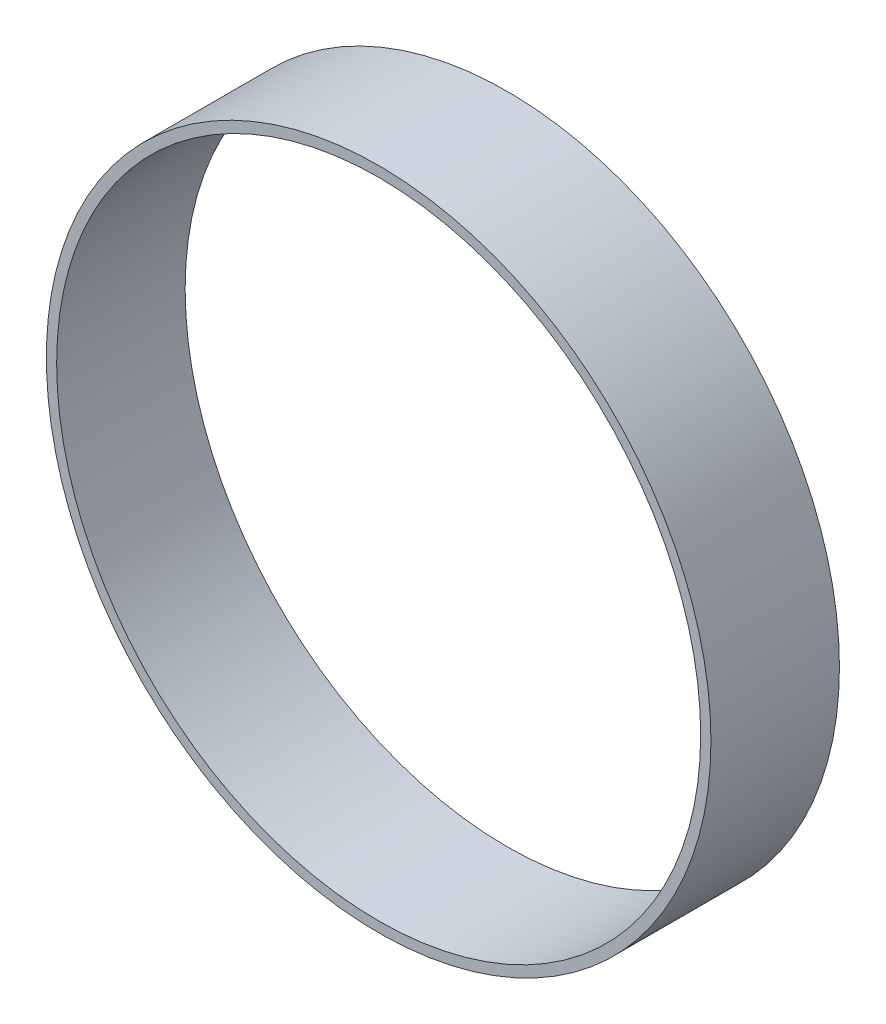
ISO-10303-21;
HEADER;
FILE_DESCRIPTION(('STEP AP214'),'2;1');
FILE_NAME('part.step','',(''),(''),'','','');
FILE_SCHEMA(('AUTOMOTIVE_DESIGN { 1 0 10303 214 1 1 1 1 }'));
ENDSEC;
DATA;
#1=APPLICATION_CONTEXT('core data for automotive mechanical design processes');
#2=APPLICATION_PROTOCOL_DEFINITION('international standard','automotive_design',2000,#1);
#3=PRODUCT_CONTEXT('',#1,'mechanical');
#4=PRODUCT('Part','Part','',(#3));
#5=PRODUCT_RELATED_PRODUCT_CATEGORY('part','',(#4));
#6=PRODUCT_DEFINITION_FORMATION('','',#4);
#7=PRODUCT_DEFINITION_CONTEXT('part definition',#1,'design');
#8=PRODUCT_DEFINITION('design','',#6,#7);
#9=PRODUCT_DEFINITION_SHAPE('','',#8);
#10=(LENGTH_UNIT() NAMED_UNIT(*) SI_UNIT(.MILLI.,.METRE.));
#11=(NAMED_UNIT(*) PLANE_ANGLE_UNIT() SI_UNIT($,.RADIAN.));
#12=(NAMED_UNIT(*) SI_UNIT($,.STERADIAN.) SOLID_ANGLE_UNIT());
#13=UNCERTAINTY_MEASURE_WITH_UNIT(LENGTH_MEASURE(1.E-05),#10,'distance_accuracy_value','');
#14=(GEOMETRIC_REPRESENTATION_CONTEXT(3) GLOBAL_UNCERTAINTY_ASSIGNED_CONTEXT((#13)) GLOBAL_UNIT_ASSIGNED_CONTEXT((#10,
#11,#12)) REPRESENTATION_CONTEXT('',''));
#15=CARTESIAN_POINT('',(0.,0.,0.));
#16=DIRECTION('',(0.,0.,1.));
#17=DIRECTION('',(1.,0.,0.));
#18=AXIS2_PLACEMENT_3D('',#15,#16,#17);
#19=CARTESIAN_POINT('',(0.,0.,6.35));
#20=DIRECTION('',(0.,0.,1.));
#21=DIRECTION('',(1.,0.,0.));
#22=AXIS2_PLACEMENT_3D('',#19,#20,#21);
#23=PLANE('',#22);
#24=CARTESIAN_POINT('',(0.,0.,6.35));
#25=DIRECTION('',(0.,0.,1.));
#26=DIRECTION('',(1.,0.,0.));
#27=AXIS2_PLACEMENT_3D('',#24,#25,#26);
#28=CIRCLE('',#27,16.4211);
#29=CARTESIAN_POINT('',(16.4211,0.,6.35));
#30=VERTEX_POINT('',#29);
#31=EDGE_CURVE('E10',#30,#30,#28,.T.);
#32=ORIENTED_EDGE('',*,*,#31,.T.);
#33=EDGE_LOOP('',(#32));
#34=FACE_BOUND('',#33,.T.);
#35=CARTESIAN_POINT('',(0.,0.,6.35));
#36=DIRECTION('',(0.,0.,1.));
#37=DIRECTION('',(1.,0.,0.));
#38=AXIS2_PLACEMENT_3D('',#35,#36,#37);
#39=CIRCLE('',#38,15.9131);
#40=CARTESIAN_POINT('',(15.9131,0.,6.35));
#41=VERTEX_POINT('',#40);
#42=EDGE_CURVE('E41',#41,#41,#39,.T.);
#43=ORIENTED_EDGE('',*,*,#42,.F.);
#44=EDGE_LOOP('',(#43));
#45=FACE_BOUND('',#44,.T.);
#46=ADVANCED_FACE('F30',(#34,#45),#23,.T.);
#47=CARTESIAN_POINT('',(0.,0.,0.));
#48=DIRECTION('',(0.,0.,1.));
#49=DIRECTION('',(1.,0.,0.));
#50=AXIS2_PLACEMENT_3D('',#47,#48,#49);
#51=PLANE('',#50);
#52=CARTESIAN_POINT('',(0.,0.,0.));
#53=DIRECTION('',(0.,0.,1.));
#54=DIRECTION('',(1.,0.,0.));
#55=AXIS2_PLACEMENT_3D('',#52,#53,#54);
#56=CIRCLE('',#55,16.4211);
#57=CARTESIAN_POINT('',(16.4211,0.,0.));
#58=VERTEX_POINT('',#57);
#59=EDGE_CURVE('E34',#58,#58,#56,.T.);
#60=ORIENTED_EDGE('',*,*,#59,.F.);
#61=EDGE_LOOP('',(#60));
#62=FACE_BOUND('',#61,.T.);
#63=CARTESIAN_POINT('',(0.,0.,0.));
#64=DIRECTION('',(0.,0.,1.));
#65=DIRECTION('',(1.,0.,0.));
#66=AXIS2_PLACEMENT_3D('',#63,#64,#65);
#67=CIRCLE('',#66,15.9131);
#68=CARTESIAN_POINT('',(15.9131,0.,0.));
#69=VERTEX_POINT('',#68);
#70=EDGE_CURVE('E43',#69,#69,#67,.T.);
#71=ORIENTED_EDGE('',*,*,#70,.T.);
#72=EDGE_LOOP('',(#71));
#73=FACE_BOUND('',#72,.T.);
#74=ADVANCED_FACE('F53',(#62,#73),#51,.F.);
#75=CARTESIAN_POINT('',(0.,0.,6.35));
#76=DIRECTION('',(0.,0.,-1.));
#77=DIRECTION('',(-1.,0.,0.));
#78=AXIS2_PLACEMENT_3D('',#75,#76,#77);
#79=CYLINDRICAL_SURFACE('',#78,16.4211);
#80=ORIENTED_EDGE('',*,*,#31,.F.);
#81=EDGE_LOOP('',(#80));
#82=FACE_BOUND('',#81,.T.);
#83=ORIENTED_EDGE('',*,*,#59,.T.);
#84=EDGE_LOOP('',(#83));
#85=FACE_BOUND('',#84,.T.);
#86=ADVANCED_FACE('F32',(#82,#85),#79,.T.);
#87=CARTESIAN_POINT('',(0.,0.,6.35));
#88=DIRECTION('',(0.,0.,-1.));
#89=DIRECTION('',(-1.,0.,0.));
#90=AXIS2_PLACEMENT_3D('',#87,#88,#89);
#91=CYLINDRICAL_SURFACE('',#90,15.9131);
#92=ORIENTED_EDGE('',*,*,#42,.T.);
#93=EDGE_LOOP('',(#92));
#94=FACE_BOUND('',#93,.T.);
#95=ORIENTED_EDGE('',*,*,#70,.F.);
#96=EDGE_LOOP('',(#95));
#97=FACE_BOUND('',#96,.T.);
#98=ADVANCED_FACE('F49',(#94,#97),#91,.F.);
#99=CLOSED_SHELL('',(#46,#74,#86,#98));
#100=MANIFOLD_SOLID_BREP('B2',#99);
#101=ADVANCED_BREP_SHAPE_REPRESENTATION('',(#18,#100),#14);
#102=SHAPE_DEFINITION_REPRESENTATION(#9,#101);
ENDSEC;
END-ISO-10303-21;
